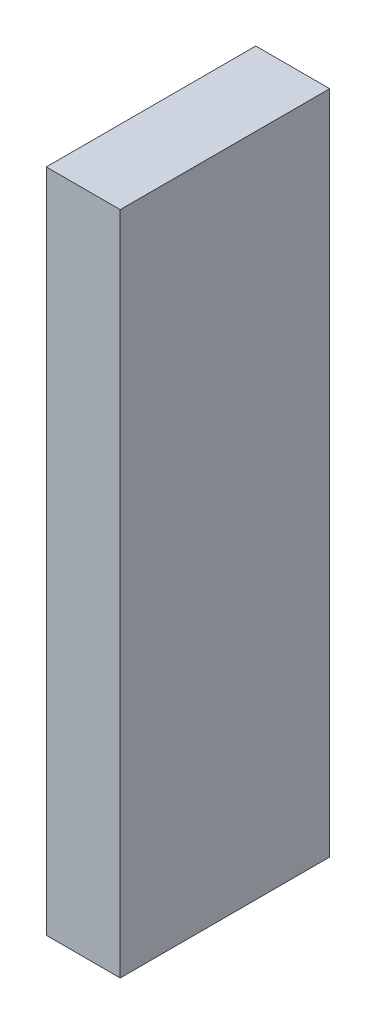
ISO-10303-21;
HEADER;
FILE_DESCRIPTION(('STEP AP214'),'2;1');
FILE_NAME('part.step','',(''),(''),'','','');
FILE_SCHEMA(('AUTOMOTIVE_DESIGN { 1 0 10303 214 1 1 1 1 }'));
ENDSEC;
DATA;
#1=APPLICATION_CONTEXT('core data for automotive mechanical design processes');
#2=APPLICATION_PROTOCOL_DEFINITION('international standard','automotive_design',2000,#1);
#3=PRODUCT_CONTEXT('',#1,'mechanical');
#4=PRODUCT('Part','Part','',(#3));
#5=PRODUCT_RELATED_PRODUCT_CATEGORY('part','',(#4));
#6=PRODUCT_DEFINITION_FORMATION('','',#4);
#7=PRODUCT_DEFINITION_CONTEXT('part definition',#1,'design');
#8=PRODUCT_DEFINITION('design','',#6,#7);
#9=PRODUCT_DEFINITION_SHAPE('','',#8);
#10=(LENGTH_UNIT() NAMED_UNIT(*) SI_UNIT(.MILLI.,.METRE.));
#11=(NAMED_UNIT(*) PLANE_ANGLE_UNIT() SI_UNIT($,.RADIAN.));
#12=(NAMED_UNIT(*) SI_UNIT($,.STERADIAN.) SOLID_ANGLE_UNIT());
#13=UNCERTAINTY_MEASURE_WITH_UNIT(LENGTH_MEASURE(1.E-05),#10,'distance_accuracy_value','');
#14=(GEOMETRIC_REPRESENTATION_CONTEXT(3) GLOBAL_UNCERTAINTY_ASSIGNED_CONTEXT((#13)) GLOBAL_UNIT_ASSIGNED_CONTEXT((#10,
#11,#12)) REPRESENTATION_CONTEXT('',''));
#15=CARTESIAN_POINT('',(0.,0.,0.));
#16=DIRECTION('',(0.,0.,1.));
#17=DIRECTION('',(1.,0.,0.));
#18=AXIS2_PLACEMENT_3D('',#15,#16,#17);
#19=CARTESIAN_POINT('',(2.449997094692,2.69998244459617,0.));
#20=DIRECTION('',(-1.,1.19248806385031E-08,0.));
#21=DIRECTION('',(-1.19248806385031E-08,-1.,0.));
#22=AXIS2_PLACEMENT_3D('',#19,#20,#21);
#23=PLANE('',#22);
#24=DIRECTION('',(-1.19248806627069E-08,-1.,0.));
#25=VECTOR('',#24,1.);
#26=CARTESIAN_POINT('',(2.449997094692,2.69998244459617,0.));
#27=LINE('',#26,#25);
#28=CARTESIAN_POINT('',(2.449997094692,2.69998244459617,0.));
#29=VERTEX_POINT('',#28);
#30=CARTESIAN_POINT('',(2.44999703029772,-2.7000114518882,0.));
#31=VERTEX_POINT('',#30);
#32=EDGE_CURVE('E11',#29,#31,#27,.T.);
#33=ORIENTED_EDGE('',*,*,#32,.T.);
#34=DIRECTION('',(0.,0.,1.));
#35=VECTOR('',#34,1.);
#36=CARTESIAN_POINT('',(2.44999703029772,-2.7000114518882,0.));
#37=LINE('',#36,#35);
#38=CARTESIAN_POINT('',(2.44999703029772,-2.7000114518882,1.6999990940094));
#39=VERTEX_POINT('',#38);
#40=EDGE_CURVE('E88',#31,#39,#37,.T.);
#41=ORIENTED_EDGE('',*,*,#40,.T.);
#42=DIRECTION('',(-1.19248806627069E-08,-1.,0.));
#43=VECTOR('',#42,1.);
#44=CARTESIAN_POINT('',(2.449997094692,2.69998244459617,1.6999990940094));
#45=LINE('',#44,#43);
#46=CARTESIAN_POINT('',(2.449997094692,2.69998244459617,1.6999990940094));
#47=VERTEX_POINT('',#46);
#48=EDGE_CURVE('E83',#47,#39,#45,.T.);
#49=ORIENTED_EDGE('',*,*,#48,.F.);
#50=DIRECTION('',(0.,0.,1.));
#51=VECTOR('',#50,1.);
#52=CARTESIAN_POINT('',(2.449997094692,2.69998244459619,0.));
#53=LINE('',#52,#51);
#54=EDGE_CURVE('E72',#29,#47,#53,.T.);
#55=ORIENTED_EDGE('',*,*,#54,.F.);
#56=EDGE_LOOP('',(#33,#41,#49,#55));
#57=FACE_BOUND('',#56,.T.);
#58=ADVANCED_FACE('F17',(#57),#23,.T.);
#59=CARTESIAN_POINT('',(2.44999703029772,-2.7000114518882,0.));
#60=DIRECTION('',(-1.19248806385031E-08,-1.,0.));
#61=DIRECTION('',(1.,-1.19248806385031E-08,0.));
#62=AXIS2_PLACEMENT_3D('',#59,#60,#61);
#63=PLANE('',#62);
#64=DIRECTION('',(1.,-1.1924880741852E-08,0.));
#65=VECTOR('',#64,1.);
#66=CARTESIAN_POINT('',(2.44999703029772,-2.7000114518882,0.));
#67=LINE('',#66,#65);
#68=CARTESIAN_POINT('',(3.04999931911608,-2.70001145904314,0.));
#69=VERTEX_POINT('',#68);
#70=EDGE_CURVE('E24',#31,#69,#67,.T.);
#71=ORIENTED_EDGE('',*,*,#70,.T.);
#72=DIRECTION('',(0.,0.,1.));
#73=VECTOR('',#72,1.);
#74=CARTESIAN_POINT('',(3.04999931911608,-2.70001145904316,0.));
#75=LINE('',#74,#73);
#76=CARTESIAN_POINT('',(3.04999931911608,-2.70001145904314,1.6999990940094));
#77=VERTEX_POINT('',#76);
#78=EDGE_CURVE('E85',#69,#77,#75,.T.);
#79=ORIENTED_EDGE('',*,*,#78,.T.);
#80=DIRECTION('',(1.,-1.1924880741852E-08,0.));
#81=VECTOR('',#80,1.);
#82=CARTESIAN_POINT('',(2.44999703029772,-2.7000114518882,1.6999990940094));
#83=LINE('',#82,#81);
#84=EDGE_CURVE('E66',#39,#77,#83,.T.);
#85=ORIENTED_EDGE('',*,*,#84,.F.);
#86=ORIENTED_EDGE('',*,*,#40,.F.);
#87=EDGE_LOOP('',(#71,#79,#85,#86));
#88=FACE_BOUND('',#87,.T.);
#89=ADVANCED_FACE('F89',(#88),#63,.T.);
#90=CARTESIAN_POINT('',(3.04999931911608,-2.70001145904314,0.));
#91=DIRECTION('',(1.,-1.19248806385031E-08,0.));
#92=DIRECTION('',(1.19248806385031E-08,1.,0.));
#93=AXIS2_PLACEMENT_3D('',#90,#91,#92);
#94=PLANE('',#93);
#95=DIRECTION('',(1.19248806627069E-08,1.,0.));
#96=VECTOR('',#95,1.);
#97=CARTESIAN_POINT('',(3.04999931911608,-2.70001145904314,0.));
#98=LINE('',#97,#96);
#99=CARTESIAN_POINT('',(3.04999938351036,2.69998243744124,0.));
#100=VERTEX_POINT('',#99);
#101=EDGE_CURVE('E62',#69,#100,#98,.T.);
#102=ORIENTED_EDGE('',*,*,#101,.T.);
#103=DIRECTION('',(0.,0.,1.));
#104=VECTOR('',#103,1.);
#105=CARTESIAN_POINT('',(3.04999938351037,2.69998243744124,0.));
#106=LINE('',#105,#104);
#107=CARTESIAN_POINT('',(3.04999938351036,2.69998243744124,1.6999990940094));
#108=VERTEX_POINT('',#107);
#109=EDGE_CURVE('E55',#100,#108,#106,.T.);
#110=ORIENTED_EDGE('',*,*,#109,.T.);
#111=DIRECTION('',(1.19248806627069E-08,1.,0.));
#112=VECTOR('',#111,1.);
#113=CARTESIAN_POINT('',(3.04999931911608,-2.70001145904314,1.6999990940094));
#114=LINE('',#113,#112);
#115=EDGE_CURVE('E59',#77,#108,#114,.T.);
#116=ORIENTED_EDGE('',*,*,#115,.F.);
#117=ORIENTED_EDGE('',*,*,#78,.F.);
#118=EDGE_LOOP('',(#102,#110,#116,#117));
#119=FACE_BOUND('',#118,.T.);
#120=ADVANCED_FACE('F57',(#119),#94,.T.);
#121=CARTESIAN_POINT('',(3.04999938351036,2.69998243744124,0.));
#122=DIRECTION('',(1.19248806385031E-08,1.,0.));
#123=DIRECTION('',(-1.,1.19248806385031E-08,0.));
#124=AXIS2_PLACEMENT_3D('',#121,#122,#123);
#125=PLANE('',#124);
#126=DIRECTION('',(-1.,1.1924880741852E-08,0.));
#127=VECTOR('',#126,1.);
#128=CARTESIAN_POINT('',(3.04999938351036,2.69998243744124,0.));
#129=LINE('',#128,#127);
#130=EDGE_CURVE('E65',#100,#29,#129,.T.);
#131=ORIENTED_EDGE('',*,*,#130,.T.);
#132=ORIENTED_EDGE('',*,*,#54,.T.);
#133=DIRECTION('',(-1.,1.1924880741852E-08,0.));
#134=VECTOR('',#133,1.);
#135=CARTESIAN_POINT('',(3.04999938351036,2.69998243744124,1.6999990940094));
#136=LINE('',#135,#134);
#137=EDGE_CURVE('E70',#108,#47,#136,.T.);
#138=ORIENTED_EDGE('',*,*,#137,.F.);
#139=ORIENTED_EDGE('',*,*,#109,.F.);
#140=EDGE_LOOP('',(#131,#132,#138,#139));
#141=FACE_BOUND('',#140,.T.);
#142=ADVANCED_FACE('F71',(#141),#125,.T.);
#143=CARTESIAN_POINT('',(65.7749938964844,-329.475006103516,1.6999990940094));
#144=DIRECTION('',(0.,0.,1.));
#145=DIRECTION('',(1.19248806385031E-08,1.,0.));
#146=AXIS2_PLACEMENT_3D('',#143,#144,#145);
#147=PLANE('',#146);
#148=ORIENTED_EDGE('',*,*,#48,.T.);
#149=ORIENTED_EDGE('',*,*,#84,.T.);
#150=ORIENTED_EDGE('',*,*,#115,.T.);
#151=ORIENTED_EDGE('',*,*,#137,.T.);
#152=EDGE_LOOP('',(#148,#149,#150,#151));
#153=FACE_BOUND('',#152,.T.);
#154=ADVANCED_FACE('F76',(#153),#147,.T.);
#155=CARTESIAN_POINT('',(65.7749938964844,-329.475006103516,0.));
#156=DIRECTION('',(0.,0.,1.));
#157=DIRECTION('',(1.19248806385031E-08,1.,0.));
#158=AXIS2_PLACEMENT_3D('',#155,#156,#157);
#159=PLANE('',#158);
#160=ORIENTED_EDGE('',*,*,#130,.F.);
#161=ORIENTED_EDGE('',*,*,#101,.F.);
#162=ORIENTED_EDGE('',*,*,#70,.F.);
#163=ORIENTED_EDGE('',*,*,#32,.F.);
#164=EDGE_LOOP('',(#160,#161,#162,#163));
#165=FACE_BOUND('',#164,.T.);
#166=ADVANCED_FACE('F91',(#165),#159,.F.);
#167=CLOSED_SHELL('',(#58,#89,#120,#142,#154,#166));
#168=MANIFOLD_SOLID_BREP('B1',#167);
#169=ADVANCED_BREP_SHAPE_REPRESENTATION('',(#18,#168),#14);
#170=SHAPE_DEFINITION_REPRESENTATION(#9,#169);
ENDSEC;
END-ISO-10303-21;
